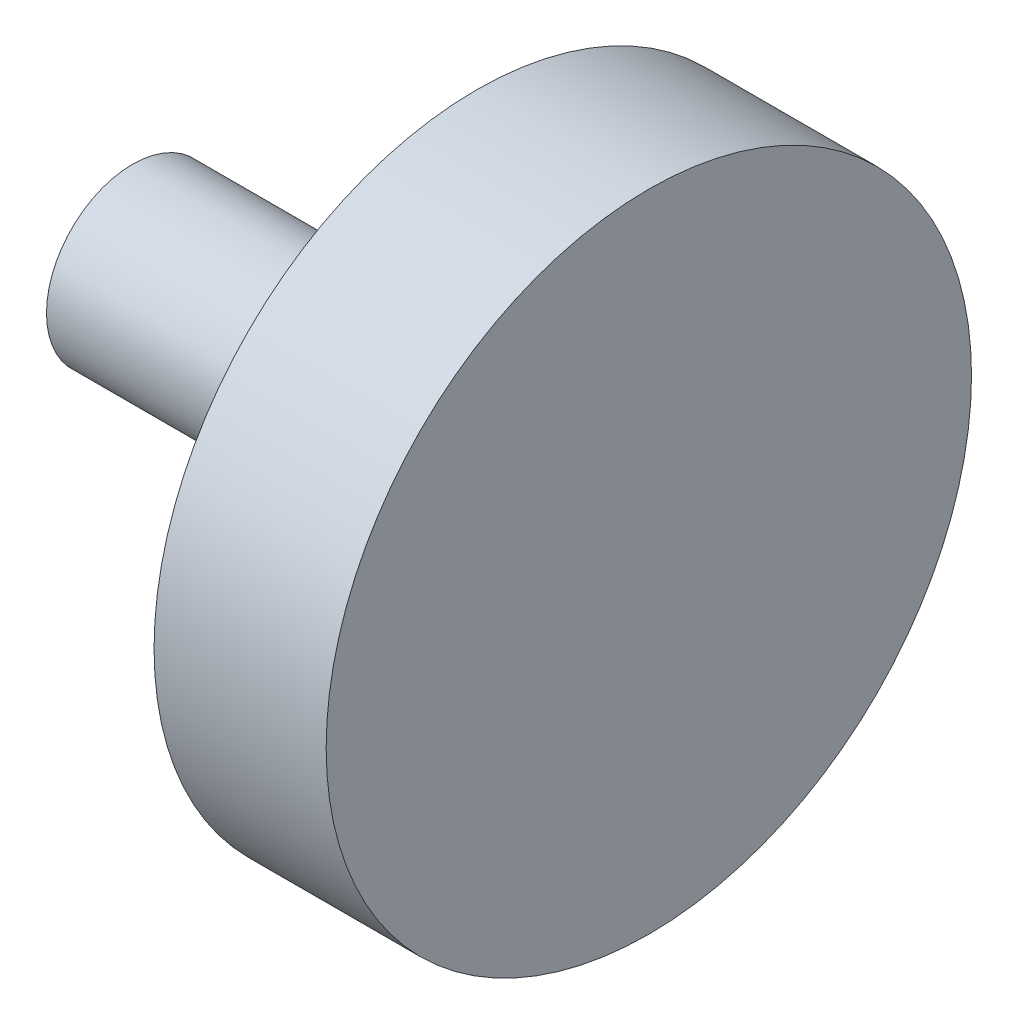
ISO-10303-21;
HEADER;
FILE_DESCRIPTION(('STEP AP214'),'2;1');
FILE_NAME('part.step','',(''),(''),'','','');
FILE_SCHEMA(('AUTOMOTIVE_DESIGN { 1 0 10303 214 1 1 1 1 }'));
ENDSEC;
DATA;
#1=APPLICATION_CONTEXT('core data for automotive mechanical design processes');
#2=APPLICATION_PROTOCOL_DEFINITION('international standard','automotive_design',2000,#1);
#3=PRODUCT_CONTEXT('',#1,'mechanical');
#4=PRODUCT('Part','Part','',(#3));
#5=PRODUCT_RELATED_PRODUCT_CATEGORY('part','',(#4));
#6=PRODUCT_DEFINITION_FORMATION('','',#4);
#7=PRODUCT_DEFINITION_CONTEXT('part definition',#1,'design');
#8=PRODUCT_DEFINITION('design','',#6,#7);
#9=PRODUCT_DEFINITION_SHAPE('','',#8);
#10=(LENGTH_UNIT() NAMED_UNIT(*) SI_UNIT(.MILLI.,.METRE.));
#11=(NAMED_UNIT(*) PLANE_ANGLE_UNIT() SI_UNIT($,.RADIAN.));
#12=(NAMED_UNIT(*) SI_UNIT($,.STERADIAN.) SOLID_ANGLE_UNIT());
#13=UNCERTAINTY_MEASURE_WITH_UNIT(LENGTH_MEASURE(1.E-05),#10,'distance_accuracy_value','');
#14=(GEOMETRIC_REPRESENTATION_CONTEXT(3) GLOBAL_UNCERTAINTY_ASSIGNED_CONTEXT((#13)) GLOBAL_UNIT_ASSIGNED_CONTEXT((#10,
#11,#12)) REPRESENTATION_CONTEXT('',''));
#15=CARTESIAN_POINT('',(0.,0.,0.));
#16=DIRECTION('',(0.,0.,1.));
#17=DIRECTION('',(1.,0.,0.));
#18=AXIS2_PLACEMENT_3D('',#15,#16,#17);
#19=CARTESIAN_POINT('',(0.,0.,0.));
#20=DIRECTION('',(1.,0.,0.));
#21=DIRECTION('',(0.,0.,-1.));
#22=AXIS2_PLACEMENT_3D('',#19,#20,#21);
#23=PLANE('',#22);
#24=CARTESIAN_POINT('',(0.,0.,0.));
#25=DIRECTION('',(1.,0.,0.));
#26=DIRECTION('',(0.,0.,-1.));
#27=AXIS2_PLACEMENT_3D('',#24,#25,#26);
#28=CIRCLE('',#27,7.5);
#29=CARTESIAN_POINT('',(0.,0.,-7.5));
#30=VERTEX_POINT('',#29);
#31=EDGE_CURVE('E41',#30,#30,#28,.T.);
#32=ORIENTED_EDGE('',*,*,#31,.F.);
#33=EDGE_LOOP('',(#32));
#34=FACE_BOUND('',#33,.T.);
#35=CARTESIAN_POINT('',(0.,0.,0.));
#36=DIRECTION('',(1.,0.,0.));
#37=DIRECTION('',(0.,0.,-1.));
#38=AXIS2_PLACEMENT_3D('',#35,#36,#37);
#39=CIRCLE('',#38,2.);
#40=CARTESIAN_POINT('',(0.,0.,-2.));
#41=VERTEX_POINT('',#40);
#42=EDGE_CURVE('E10',#41,#41,#39,.F.);
#43=ORIENTED_EDGE('',*,*,#42,.F.);
#44=EDGE_LOOP('',(#43));
#45=FACE_BOUND('',#44,.T.);
#46=ADVANCED_FACE('F30',(#34,#45),#23,.F.);
#47=CARTESIAN_POINT('',(4.,0.,0.));
#48=DIRECTION('',(-1.,0.,0.));
#49=DIRECTION('',(0.,0.,1.));
#50=AXIS2_PLACEMENT_3D('',#47,#48,#49);
#51=CYLINDRICAL_SURFACE('',#50,7.5);
#52=CARTESIAN_POINT('',(4.,0.,0.));
#53=DIRECTION('',(1.,0.,0.));
#54=DIRECTION('',(0.,0.,-1.));
#55=AXIS2_PLACEMENT_3D('',#52,#53,#54);
#56=CIRCLE('',#55,7.5);
#57=CARTESIAN_POINT('',(4.,0.,-7.5));
#58=VERTEX_POINT('',#57);
#59=EDGE_CURVE('E37',#58,#58,#56,.T.);
#60=ORIENTED_EDGE('',*,*,#59,.F.);
#61=EDGE_LOOP('',(#60));
#62=FACE_BOUND('',#61,.T.);
#63=ORIENTED_EDGE('',*,*,#31,.T.);
#64=EDGE_LOOP('',(#63));
#65=FACE_BOUND('',#64,.T.);
#66=ADVANCED_FACE('F32',(#62,#65),#51,.T.);
#67=CARTESIAN_POINT('',(4.,0.,0.));
#68=DIRECTION('',(1.,0.,0.));
#69=DIRECTION('',(0.,0.,-1.));
#70=AXIS2_PLACEMENT_3D('',#67,#68,#69);
#71=PLANE('',#70);
#72=ORIENTED_EDGE('',*,*,#59,.T.);
#73=EDGE_LOOP('',(#72));
#74=FACE_BOUND('',#73,.T.);
#75=ADVANCED_FACE('F55',(#74),#71,.T.);
#76=CARTESIAN_POINT('',(-8.,0.,0.));
#77=DIRECTION('',(1.,0.,0.));
#78=DIRECTION('',(0.,0.,-1.));
#79=AXIS2_PLACEMENT_3D('',#76,#77,#78);
#80=CYLINDRICAL_SURFACE('',#79,2.);
#81=CARTESIAN_POINT('',(-8.,0.,0.));
#82=DIRECTION('',(-1.,0.,0.));
#83=DIRECTION('',(0.,0.,1.));
#84=AXIS2_PLACEMENT_3D('',#81,#82,#83);
#85=CIRCLE('',#84,2.);
#86=CARTESIAN_POINT('',(-8.,0.,2.));
#87=VERTEX_POINT('',#86);
#88=EDGE_CURVE('E46',#87,#87,#85,.T.);
#89=ORIENTED_EDGE('',*,*,#88,.F.);
#90=EDGE_LOOP('',(#89));
#91=FACE_BOUND('',#90,.T.);
#92=ORIENTED_EDGE('',*,*,#42,.T.);
#93=EDGE_LOOP('',(#92));
#94=FACE_BOUND('',#93,.T.);
#95=ADVANCED_FACE('F53',(#91,#94),#80,.T.);
#96=CARTESIAN_POINT('',(-8.,0.,0.));
#97=DIRECTION('',(-1.,0.,0.));
#98=DIRECTION('',(0.,0.,1.));
#99=AXIS2_PLACEMENT_3D('',#96,#97,#98);
#100=PLANE('',#99);
#101=ORIENTED_EDGE('',*,*,#88,.T.);
#102=EDGE_LOOP('',(#101));
#103=FACE_BOUND('',#102,.T.);
#104=ADVANCED_FACE('F51',(#103),#100,.T.);
#105=CLOSED_SHELL('',(#46,#66,#75,#95,#104));
#106=MANIFOLD_SOLID_BREP('B2',#105);
#107=ADVANCED_BREP_SHAPE_REPRESENTATION('',(#18,#106),#14);
#108=SHAPE_DEFINITION_REPRESENTATION(#9,#107);
ENDSEC;
END-ISO-10303-21;
